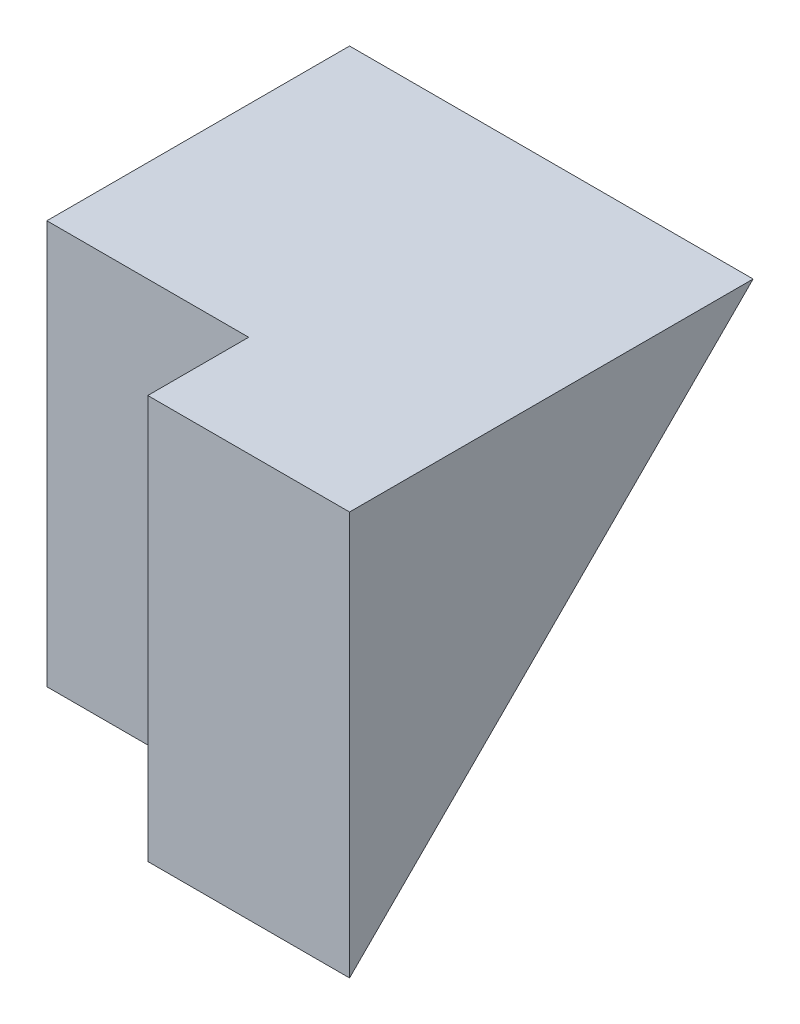
ISO-10303-21;
HEADER;
FILE_DESCRIPTION(('STEP AP214'),'2;1');
FILE_NAME('part.step','',(''),(''),'','','');
FILE_SCHEMA(('AUTOMOTIVE_DESIGN { 1 0 10303 214 1 1 1 1 }'));
ENDSEC;
DATA;
#1=APPLICATION_CONTEXT('core data for automotive mechanical design processes');
#2=APPLICATION_PROTOCOL_DEFINITION('international standard','automotive_design',2000,#1);
#3=PRODUCT_CONTEXT('',#1,'mechanical');
#4=PRODUCT('Part','Part','',(#3));
#5=PRODUCT_RELATED_PRODUCT_CATEGORY('part','',(#4));
#6=PRODUCT_DEFINITION_FORMATION('','',#4);
#7=PRODUCT_DEFINITION_CONTEXT('part definition',#1,'design');
#8=PRODUCT_DEFINITION('design','',#6,#7);
#9=PRODUCT_DEFINITION_SHAPE('','',#8);
#10=(LENGTH_UNIT() NAMED_UNIT(*) SI_UNIT(.MILLI.,.METRE.));
#11=(NAMED_UNIT(*) PLANE_ANGLE_UNIT() SI_UNIT($,.RADIAN.));
#12=(NAMED_UNIT(*) SI_UNIT($,.STERADIAN.) SOLID_ANGLE_UNIT());
#13=UNCERTAINTY_MEASURE_WITH_UNIT(LENGTH_MEASURE(1.E-05),#10,'distance_accuracy_value','');
#14=(GEOMETRIC_REPRESENTATION_CONTEXT(3) GLOBAL_UNCERTAINTY_ASSIGNED_CONTEXT((#13)) GLOBAL_UNIT_ASSIGNED_CONTEXT((#10,
#11,#12)) REPRESENTATION_CONTEXT('',''));
#15=CARTESIAN_POINT('',(0.,0.,0.));
#16=DIRECTION('',(0.,0.,1.));
#17=DIRECTION('',(1.,0.,0.));
#18=AXIS2_PLACEMENT_3D('',#15,#16,#17);
#19=CARTESIAN_POINT('',(2.,0.,0.));
#20=DIRECTION('',(0.,1.,0.));
#21=DIRECTION('',(0.,0.,1.));
#22=AXIS2_PLACEMENT_3D('',#19,#20,#21);
#23=PLANE('',#22);
#24=DIRECTION('',(0.,0.,-1.));
#25=VECTOR('',#24,1.);
#26=CARTESIAN_POINT('',(0.,0.,0.));
#27=LINE('',#26,#25);
#28=CARTESIAN_POINT('',(0.,0.,-1.));
#29=VERTEX_POINT('',#28);
#30=CARTESIAN_POINT('',(0.,0.,-4.));
#31=VERTEX_POINT('',#30);
#32=EDGE_CURVE('E105',#29,#31,#27,.T.);
#33=ORIENTED_EDGE('',*,*,#32,.F.);
#34=DIRECTION('',(1.,0.,0.));
#35=VECTOR('',#34,1.);
#36=CARTESIAN_POINT('',(-2.,0.,-1.));
#37=LINE('',#36,#35);
#38=CARTESIAN_POINT('',(-2.,0.,-1.));
#39=VERTEX_POINT('',#38);
#40=EDGE_CURVE('E111',#39,#29,#37,.T.);
#41=ORIENTED_EDGE('',*,*,#40,.F.);
#42=DIRECTION('',(0.,0.,1.));
#43=VECTOR('',#42,1.);
#44=CARTESIAN_POINT('',(-2.,0.,-4.));
#45=LINE('',#44,#43);
#46=CARTESIAN_POINT('',(-2.,0.,-4.));
#47=VERTEX_POINT('',#46);
#48=EDGE_CURVE('E128',#47,#39,#45,.T.);
#49=ORIENTED_EDGE('',*,*,#48,.F.);
#50=DIRECTION('',(-1.,0.,0.));
#51=VECTOR('',#50,1.);
#52=CARTESIAN_POINT('',(2.,0.,-4.));
#53=LINE('',#52,#51);
#54=EDGE_CURVE('E42',#31,#47,#53,.T.);
#55=ORIENTED_EDGE('',*,*,#54,.F.);
#56=EDGE_LOOP('',(#33,#41,#49,#55));
#57=FACE_BOUND('',#56,.T.);
#58=ADVANCED_FACE('F32',(#57),#23,.F.);
#59=CARTESIAN_POINT('',(2.,0.,-4.));
#60=DIRECTION('',(0.,0.,1.));
#61=DIRECTION('',(1.,0.,0.));
#62=AXIS2_PLACEMENT_3D('',#59,#60,#61);
#63=PLANE('',#62);
#64=DIRECTION('',(0.,1.,0.));
#65=VECTOR('',#64,1.);
#66=CARTESIAN_POINT('',(0.,0.,-4.));
#67=LINE('',#66,#65);
#68=CARTESIAN_POINT('',(0.,4.,-4.));
#69=VERTEX_POINT('',#68);
#70=EDGE_CURVE('E149',#31,#69,#67,.T.);
#71=ORIENTED_EDGE('',*,*,#70,.F.);
#72=ORIENTED_EDGE('',*,*,#54,.T.);
#73=DIRECTION('',(0.,-1.,0.));
#74=VECTOR('',#73,1.);
#75=CARTESIAN_POINT('',(-2.,4.,-4.));
#76=LINE('',#75,#74);
#77=CARTESIAN_POINT('',(-2.,4.,-4.));
#78=VERTEX_POINT('',#77);
#79=EDGE_CURVE('E132',#78,#47,#76,.T.);
#80=ORIENTED_EDGE('',*,*,#79,.F.);
#81=DIRECTION('',(-1.,0.,0.));
#82=VECTOR('',#81,1.);
#83=CARTESIAN_POINT('',(2.,4.,-4.));
#84=LINE('',#83,#82);
#85=EDGE_CURVE('E135',#69,#78,#84,.T.);
#86=ORIENTED_EDGE('',*,*,#85,.F.);
#87=EDGE_LOOP('',(#71,#72,#80,#86));
#88=FACE_BOUND('',#87,.T.);
#89=ADVANCED_FACE('F147',(#88),#63,.F.);
#90=CARTESIAN_POINT('',(2.,0.,0.));
#91=DIRECTION('',(-1.,0.,0.));
#92=DIRECTION('',(0.,0.,1.));
#93=AXIS2_PLACEMENT_3D('',#90,#91,#92);
#94=PLANE('',#93);
#95=DIRECTION('',(0.,0.707106781186548,-0.707106781186548));
#96=VECTOR('',#95,1.);
#97=CARTESIAN_POINT('',(2.,0.,0.));
#98=LINE('',#97,#96);
#99=CARTESIAN_POINT('',(2.,0.,0.));
#100=VERTEX_POINT('',#99);
#101=CARTESIAN_POINT('',(2.,4.,-4.));
#102=VERTEX_POINT('',#101);
#103=EDGE_CURVE('E94',#100,#102,#98,.T.);
#104=ORIENTED_EDGE('',*,*,#103,.T.);
#105=DIRECTION('',(0.,0.,1.));
#106=VECTOR('',#105,1.);
#107=CARTESIAN_POINT('',(2.,4.,0.));
#108=LINE('',#107,#106);
#109=CARTESIAN_POINT('',(2.,4.,0.));
#110=VERTEX_POINT('',#109);
#111=EDGE_CURVE('E58',#102,#110,#108,.T.);
#112=ORIENTED_EDGE('',*,*,#111,.T.);
#113=DIRECTION('',(0.,-1.,0.));
#114=VECTOR('',#113,1.);
#115=CARTESIAN_POINT('',(2.,0.,0.));
#116=LINE('',#115,#114);
#117=EDGE_CURVE('E113',#110,#100,#116,.T.);
#118=ORIENTED_EDGE('',*,*,#117,.T.);
#119=EDGE_LOOP('',(#104,#112,#118));
#120=FACE_BOUND('',#119,.T.);
#121=ADVANCED_FACE('F186',(#120),#94,.F.);
#122=CARTESIAN_POINT('',(0.,0.,0.));
#123=DIRECTION('',(-1.,0.,0.));
#124=DIRECTION('',(0.,0.,1.));
#125=AXIS2_PLACEMENT_3D('',#122,#123,#124);
#126=PLANE('',#125);
#127=DIRECTION('',(0.,1.,0.));
#128=VECTOR('',#127,1.);
#129=CARTESIAN_POINT('',(0.,0.,-1.));
#130=LINE('',#129,#128);
#131=CARTESIAN_POINT('',(0.,1.,-1.));
#132=VERTEX_POINT('',#131);
#133=CARTESIAN_POINT('',(0.,4.,-1.));
#134=VERTEX_POINT('',#133);
#135=EDGE_CURVE('E36',#132,#134,#130,.T.);
#136=ORIENTED_EDGE('',*,*,#135,.F.);
#137=DIRECTION('',(0.,0.707106781186548,-0.707106781186548));
#138=VECTOR('',#137,1.);
#139=CARTESIAN_POINT('',(0.,0.,0.));
#140=LINE('',#139,#138);
#141=CARTESIAN_POINT('',(0.,0.,0.));
#142=VERTEX_POINT('',#141);
#143=EDGE_CURVE('E49',#142,#132,#140,.T.);
#144=ORIENTED_EDGE('',*,*,#143,.F.);
#145=DIRECTION('',(0.,-1.,0.));
#146=VECTOR('',#145,1.);
#147=CARTESIAN_POINT('',(0.,0.,0.));
#148=LINE('',#147,#146);
#149=CARTESIAN_POINT('',(0.,4.,0.));
#150=VERTEX_POINT('',#149);
#151=EDGE_CURVE('E103',#150,#142,#148,.T.);
#152=ORIENTED_EDGE('',*,*,#151,.F.);
#153=DIRECTION('',(0.,0.,1.));
#154=VECTOR('',#153,1.);
#155=CARTESIAN_POINT('',(0.,4.,0.));
#156=LINE('',#155,#154);
#157=EDGE_CURVE('E110',#134,#150,#156,.T.);
#158=ORIENTED_EDGE('',*,*,#157,.F.);
#159=EDGE_LOOP('',(#136,#144,#152,#158));
#160=FACE_BOUND('',#159,.T.);
#161=ADVANCED_FACE('F101',(#160),#126,.T.);
#162=CARTESIAN_POINT('',(2.,0.,0.));
#163=DIRECTION('',(0.,0.,-1.));
#164=DIRECTION('',(-1.,0.,0.));
#165=AXIS2_PLACEMENT_3D('',#162,#163,#164);
#166=PLANE('',#165);
#167=ORIENTED_EDGE('',*,*,#151,.T.);
#168=DIRECTION('',(-1.,0.,0.));
#169=VECTOR('',#168,1.);
#170=CARTESIAN_POINT('',(2.,0.,0.));
#171=LINE('',#170,#169);
#172=EDGE_CURVE('E11',#100,#142,#171,.T.);
#173=ORIENTED_EDGE('',*,*,#172,.F.);
#174=ORIENTED_EDGE('',*,*,#117,.F.);
#175=DIRECTION('',(-1.,0.,0.));
#176=VECTOR('',#175,1.);
#177=CARTESIAN_POINT('',(2.,4.,0.));
#178=LINE('',#177,#176);
#179=EDGE_CURVE('E109',#110,#150,#178,.T.);
#180=ORIENTED_EDGE('',*,*,#179,.T.);
#181=EDGE_LOOP('',(#167,#173,#174,#180));
#182=FACE_BOUND('',#181,.T.);
#183=ADVANCED_FACE('F34',(#182),#166,.F.);
#184=CARTESIAN_POINT('',(2.,4.,0.));
#185=DIRECTION('',(0.,-1.,0.));
#186=DIRECTION('',(0.,0.,-1.));
#187=AXIS2_PLACEMENT_3D('',#184,#185,#186);
#188=PLANE('',#187);
#189=EDGE_CURVE('E136',#102,#69,#84,.T.);
#190=ORIENTED_EDGE('',*,*,#189,.T.);
#191=ORIENTED_EDGE('',*,*,#85,.T.);
#192=DIRECTION('',(0.,0.,-1.));
#193=VECTOR('',#192,1.);
#194=CARTESIAN_POINT('',(-2.,4.,-1.));
#195=LINE('',#194,#193);
#196=CARTESIAN_POINT('',(-2.,4.,-1.));
#197=VERTEX_POINT('',#196);
#198=EDGE_CURVE('E157',#197,#78,#195,.T.);
#199=ORIENTED_EDGE('',*,*,#198,.F.);
#200=DIRECTION('',(1.,0.,0.));
#201=VECTOR('',#200,1.);
#202=CARTESIAN_POINT('',(-2.,4.,-1.));
#203=LINE('',#202,#201);
#204=EDGE_CURVE('E116',#197,#134,#203,.T.);
#205=ORIENTED_EDGE('',*,*,#204,.T.);
#206=ORIENTED_EDGE('',*,*,#157,.T.);
#207=ORIENTED_EDGE('',*,*,#179,.F.);
#208=ORIENTED_EDGE('',*,*,#111,.F.);
#209=EDGE_LOOP('',(#190,#191,#199,#205,#206,#207,#208));
#210=FACE_BOUND('',#209,.T.);
#211=ADVANCED_FACE('F171',(#210),#188,.F.);
#212=CARTESIAN_POINT('',(-2.,0.,-1.));
#213=DIRECTION('',(0.,0.,-1.));
#214=DIRECTION('',(-1.,0.,0.));
#215=AXIS2_PLACEMENT_3D('',#212,#213,#214);
#216=PLANE('',#215);
#217=EDGE_CURVE('E126',#29,#132,#130,.T.);
#218=ORIENTED_EDGE('',*,*,#217,.T.);
#219=ORIENTED_EDGE('',*,*,#135,.T.);
#220=ORIENTED_EDGE('',*,*,#204,.F.);
#221=DIRECTION('',(0.,1.,0.));
#222=VECTOR('',#221,1.);
#223=CARTESIAN_POINT('',(-2.,0.,-1.));
#224=LINE('',#223,#222);
#225=EDGE_CURVE('E158',#39,#197,#224,.T.);
#226=ORIENTED_EDGE('',*,*,#225,.F.);
#227=ORIENTED_EDGE('',*,*,#40,.T.);
#228=EDGE_LOOP('',(#218,#219,#220,#226,#227));
#229=FACE_BOUND('',#228,.T.);
#230=ADVANCED_FACE('F169',(#229),#216,.F.);
#231=CARTESIAN_POINT('',(-2.,0.,0.));
#232=DIRECTION('',(-1.,0.,0.));
#233=DIRECTION('',(0.,0.,1.));
#234=AXIS2_PLACEMENT_3D('',#231,#232,#233);
#235=PLANE('',#234);
#236=ORIENTED_EDGE('',*,*,#48,.T.);
#237=ORIENTED_EDGE('',*,*,#225,.T.);
#238=ORIENTED_EDGE('',*,*,#198,.T.);
#239=ORIENTED_EDGE('',*,*,#79,.T.);
#240=EDGE_LOOP('',(#236,#237,#238,#239));
#241=FACE_BOUND('',#240,.T.);
#242=ADVANCED_FACE('F155',(#241),#235,.T.);
#243=CARTESIAN_POINT('',(0.,0.,0.));
#244=DIRECTION('',(1.,0.,0.));
#245=DIRECTION('',(0.,0.,-1.));
#246=AXIS2_PLACEMENT_3D('',#243,#244,#245);
#247=PLANE('',#246);
#248=ORIENTED_EDGE('',*,*,#217,.F.);
#249=ORIENTED_EDGE('',*,*,#32,.T.);
#250=ORIENTED_EDGE('',*,*,#70,.T.);
#251=EDGE_CURVE('E106',#132,#69,#140,.T.);
#252=ORIENTED_EDGE('',*,*,#251,.F.);
#253=EDGE_LOOP('',(#248,#249,#250,#252));
#254=FACE_BOUND('',#253,.T.);
#255=ADVANCED_FACE('F197',(#254),#247,.T.);
#256=CARTESIAN_POINT('',(0.,0.,0.));
#257=DIRECTION('',(0.,-0.707106781186547,-0.707106781186547));
#258=DIRECTION('',(0.,0.707106781186548,-0.707106781186548));
#259=AXIS2_PLACEMENT_3D('',#256,#257,#258);
#260=PLANE('',#259);
#261=ORIENTED_EDGE('',*,*,#103,.F.);
#262=ORIENTED_EDGE('',*,*,#172,.T.);
#263=ORIENTED_EDGE('',*,*,#143,.T.);
#264=ORIENTED_EDGE('',*,*,#251,.T.);
#265=ORIENTED_EDGE('',*,*,#189,.F.);
#266=EDGE_LOOP('',(#261,#262,#263,#264,#265));
#267=FACE_BOUND('',#266,.T.);
#268=ADVANCED_FACE('F93',(#267),#260,.T.);
#269=CLOSED_SHELL('',(#58,#89,#121,#161,#183,#211,#230,#242,#255,#268));
#270=MANIFOLD_SOLID_BREP('B2',#269);
#271=ADVANCED_BREP_SHAPE_REPRESENTATION('',(#18,#270),#14);
#272=SHAPE_DEFINITION_REPRESENTATION(#9,#271);
ENDSEC;
END-ISO-10303-21;
